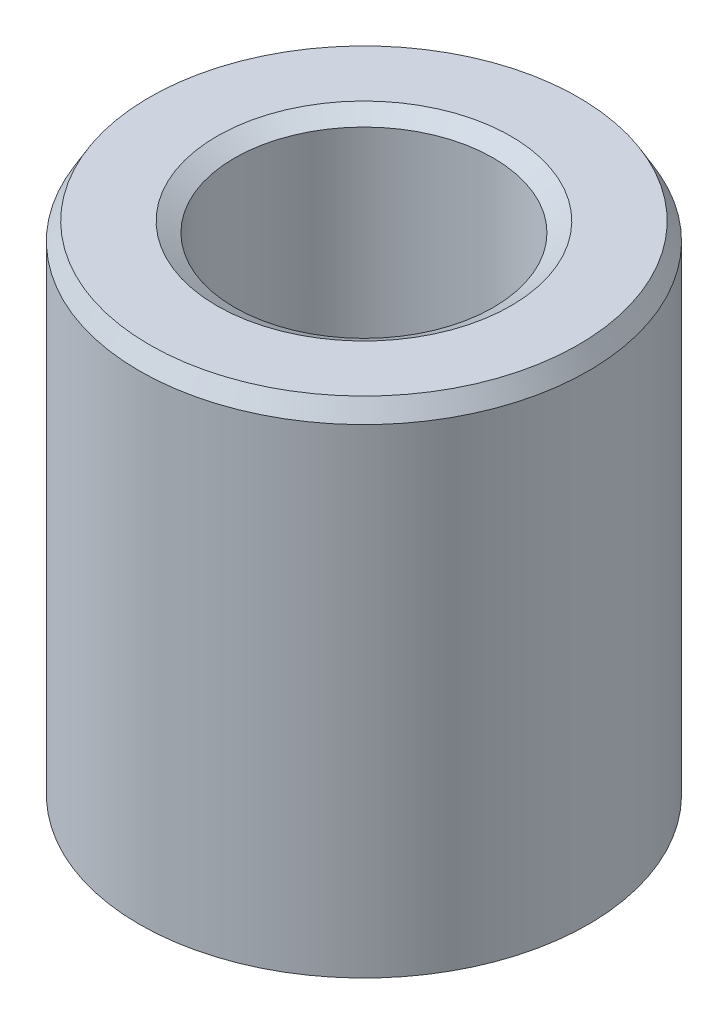
ISO-10303-21;
HEADER;
FILE_DESCRIPTION(('STEP AP214'),'2;1');
FILE_NAME('part.step','',(''),(''),'','','');
FILE_SCHEMA(('AUTOMOTIVE_DESIGN { 1 0 10303 214 1 1 1 1 }'));
ENDSEC;
DATA;
#1=APPLICATION_CONTEXT('core data for automotive mechanical design processes');
#2=APPLICATION_PROTOCOL_DEFINITION('international standard','automotive_design',2000,#1);
#3=PRODUCT_CONTEXT('',#1,'mechanical');
#4=PRODUCT('Part','Part','',(#3));
#5=PRODUCT_RELATED_PRODUCT_CATEGORY('part','',(#4));
#6=PRODUCT_DEFINITION_FORMATION('','',#4);
#7=PRODUCT_DEFINITION_CONTEXT('part definition',#1,'design');
#8=PRODUCT_DEFINITION('design','',#6,#7);
#9=PRODUCT_DEFINITION_SHAPE('','',#8);
#10=(LENGTH_UNIT() NAMED_UNIT(*) SI_UNIT(.MILLI.,.METRE.));
#11=(NAMED_UNIT(*) PLANE_ANGLE_UNIT() SI_UNIT($,.RADIAN.));
#12=(NAMED_UNIT(*) SI_UNIT($,.STERADIAN.) SOLID_ANGLE_UNIT());
#13=UNCERTAINTY_MEASURE_WITH_UNIT(LENGTH_MEASURE(1.E-05),#10,'distance_accuracy_value','');
#14=(GEOMETRIC_REPRESENTATION_CONTEXT(3) GLOBAL_UNCERTAINTY_ASSIGNED_CONTEXT((#13)) GLOBAL_UNIT_ASSIGNED_CONTEXT((#10,
#11,#12)) REPRESENTATION_CONTEXT('',''));
#15=CARTESIAN_POINT('',(0.,0.,0.));
#16=DIRECTION('',(0.,0.,1.));
#17=DIRECTION('',(1.,0.,0.));
#18=AXIS2_PLACEMENT_3D('',#15,#16,#17);
#19=CARTESIAN_POINT('',(0.,107.231433094291,0.));
#20=DIRECTION('',(0.,-1.,0.));
#21=DIRECTION('',(0.,0.,-1.));
#22=AXIS2_PLACEMENT_3D('',#19,#20,#21);
#23=CYLINDRICAL_SURFACE('',#22,47.5);
#24=CARTESIAN_POINT('',(0.,2.14270629740966,0.));
#25=DIRECTION('',(0.,1.,0.));
#26=DIRECTION('',(0.,0.,1.));
#27=AXIS2_PLACEMENT_3D('',#24,#25,#26);
#28=CIRCLE('',#27,47.5);
#29=CARTESIAN_POINT('',(0.,2.14270629740966,47.5));
#30=VERTEX_POINT('',#29);
#31=EDGE_CURVE('E10',#30,#30,#28,.T.);
#32=ORIENTED_EDGE('',*,*,#31,.T.);
#33=EDGE_LOOP('',(#32));
#34=FACE_BOUND('',#33,.T.);
#35=CARTESIAN_POINT('',(0.,103.52015692148,0.));
#36=DIRECTION('',(0.,1.,0.));
#37=DIRECTION('',(0.,0.,1.));
#38=AXIS2_PLACEMENT_3D('',#35,#36,#37);
#39=CIRCLE('',#38,47.5);
#40=CARTESIAN_POINT('',(0.,103.52015692148,47.5));
#41=VERTEX_POINT('',#40);
#42=EDGE_CURVE('E50',#41,#41,#39,.F.);
#43=ORIENTED_EDGE('',*,*,#42,.T.);
#44=EDGE_LOOP('',(#43));
#45=FACE_BOUND('',#44,.T.);
#46=ADVANCED_FACE('F39',(#34,#45),#23,.T.);
#47=CARTESIAN_POINT('',(0.,107.231433094291,0.));
#48=DIRECTION('',(0.,1.,0.));
#49=DIRECTION('',(0.,0.,1.));
#50=AXIS2_PLACEMENT_3D('',#47,#48,#49);
#51=PLANE('',#50);
#52=CARTESIAN_POINT('',(0.,107.231433094291,0.));
#53=DIRECTION('',(0.,1.,0.));
#54=DIRECTION('',(0.,0.,1.));
#55=AXIS2_PLACEMENT_3D('',#52,#53,#54);
#56=CIRCLE('',#55,31.0877086571542);
#57=CARTESIAN_POINT('',(0.,107.231433094291,31.0877086571542));
#58=VERTEX_POINT('',#57);
#59=EDGE_CURVE('E58',#58,#58,#56,.F.);
#60=ORIENTED_EDGE('',*,*,#59,.T.);
#61=EDGE_LOOP('',(#60));
#62=FACE_BOUND('',#61,.T.);
#63=CARTESIAN_POINT('',(0.,107.231433094291,0.));
#64=DIRECTION('',(0.,1.,0.));
#65=DIRECTION('',(0.,0.,1.));
#66=AXIS2_PLACEMENT_3D('',#63,#64,#65);
#67=CIRCLE('',#66,45.3572937025904);
#68=CARTESIAN_POINT('',(0.,107.231433094291,45.3572937025904));
#69=VERTEX_POINT('',#68);
#70=EDGE_CURVE('E61',#69,#69,#67,.T.);
#71=ORIENTED_EDGE('',*,*,#70,.T.);
#72=EDGE_LOOP('',(#71));
#73=FACE_BOUND('',#72,.T.);
#74=ADVANCED_FACE('F88',(#62,#73),#51,.T.);
#75=CARTESIAN_POINT('',(0.,0.,0.));
#76=DIRECTION('',(0.,1.,0.));
#77=DIRECTION('',(0.,0.,1.));
#78=AXIS2_PLACEMENT_3D('',#75,#76,#77);
#79=PLANE('',#78);
#80=CARTESIAN_POINT('',(0.,0.,0.));
#81=DIRECTION('',(0.,1.,0.));
#82=DIRECTION('',(0.,0.,1.));
#83=AXIS2_PLACEMENT_3D('',#80,#81,#82);
#84=CIRCLE('',#83,29.5191387817526);
#85=CARTESIAN_POINT('',(0.,0.,-29.5191387817526));
#86=VERTEX_POINT('',#85);
#87=EDGE_CURVE('E51',#86,#86,#84,.T.);
#88=ORIENTED_EDGE('',*,*,#87,.T.);
#89=EDGE_LOOP('',(#88));
#90=FACE_BOUND('',#89,.T.);
#91=CARTESIAN_POINT('',(0.,0.,0.));
#92=DIRECTION('',(0.,1.,0.));
#93=DIRECTION('',(0.,0.,1.));
#94=AXIS2_PLACEMENT_3D('',#91,#92,#93);
#95=CIRCLE('',#94,43.7887238271887);
#96=CARTESIAN_POINT('',(0.,0.,43.7887238271887));
#97=VERTEX_POINT('',#96);
#98=EDGE_CURVE('E54',#97,#97,#95,.F.);
#99=ORIENTED_EDGE('',*,*,#98,.T.);
#100=EDGE_LOOP('',(#99));
#101=FACE_BOUND('',#100,.T.);
#102=ADVANCED_FACE('F83',(#90,#101),#79,.F.);
#103=CARTESIAN_POINT('',(0.,107.231433094291,0.));
#104=DIRECTION('',(0.,-1.,0.));
#105=DIRECTION('',(0.,0.,-1.));
#106=AXIS2_PLACEMENT_3D('',#103,#104,#105);
#107=CYLINDRICAL_SURFACE('',#106,27.3764324843429);
#108=CARTESIAN_POINT('',(0.,105.088726796881,0.));
#109=DIRECTION('',(0.,1.,0.));
#110=DIRECTION('',(0.,0.,1.));
#111=AXIS2_PLACEMENT_3D('',#108,#109,#110);
#112=CIRCLE('',#111,27.3764324843429);
#113=CARTESIAN_POINT('',(0.,105.088726796881,27.3764324843429));
#114=VERTEX_POINT('',#113);
#115=EDGE_CURVE('E67',#114,#114,#112,.T.);
#116=ORIENTED_EDGE('',*,*,#115,.T.);
#117=EDGE_LOOP('',(#116));
#118=FACE_BOUND('',#117,.T.);
#119=CARTESIAN_POINT('',(0.,3.71127617281135,0.));
#120=DIRECTION('',(0.,1.,0.));
#121=DIRECTION('',(0.,0.,1.));
#122=AXIS2_PLACEMENT_3D('',#119,#120,#121);
#123=CIRCLE('',#122,27.3764324843429);
#124=CARTESIAN_POINT('',(0.,3.71127617281135,-27.3764324843429));
#125=VERTEX_POINT('',#124);
#126=EDGE_CURVE('E69',#125,#125,#123,.F.);
#127=ORIENTED_EDGE('',*,*,#126,.T.);
#128=EDGE_LOOP('',(#127));
#129=FACE_BOUND('',#128,.T.);
#130=ADVANCED_FACE('F71',(#118,#129),#107,.F.);
#131=CARTESIAN_POINT('',(0.,105.088726796881,0.));
#132=DIRECTION('',(0.,1.,0.));
#133=DIRECTION('',(0.,0.,1.));
#134=AXIS2_PLACEMENT_3D('',#131,#132,#133);
#135=CONICAL_SURFACE('',#134,27.3764324843429,1.0471975511966);
#136=ORIENTED_EDGE('',*,*,#59,.F.);
#137=EDGE_LOOP('',(#136));
#138=FACE_BOUND('',#137,.T.);
#139=ORIENTED_EDGE('',*,*,#115,.F.);
#140=EDGE_LOOP('',(#139));
#141=FACE_BOUND('',#140,.T.);
#142=ADVANCED_FACE('F77',(#138,#141),#135,.F.);
#143=CARTESIAN_POINT('',(0.,0.,0.));
#144=DIRECTION('',(0.,-1.,0.));
#145=DIRECTION('',(0.,0.,-1.));
#146=AXIS2_PLACEMENT_3D('',#143,#144,#145);
#147=CONICAL_SURFACE('',#146,29.5191387817526,0.523598775598292);
#148=CARTESIAN_POINT('',(0.,3.71127617281135,-27.3764324843429));
#149=CARTESIAN_POINT('',(0.,3.67261704601123,-27.3987523416076));
#150=CARTESIAN_POINT('',(0.,3.63395791921111,-27.4210721988723));
#151=CARTESIAN_POINT('',(0.,3.55663966561087,-27.4657119134017));
#152=CARTESIAN_POINT('',(0.,3.51798053881076,-27.4880317706663));
#153=CARTESIAN_POINT('',(0.,3.44066228521052,-27.5326714851957));
#154=CARTESIAN_POINT('',(0.,3.4020031584104,-27.5549913424604));
#155=CARTESIAN_POINT('',(0.,3.32468490481017,-27.5996310569898));
#156=CARTESIAN_POINT('',(0.,3.28602577801005,-27.6219509142544));
#157=CARTESIAN_POINT('',(0.,3.20870752440981,-27.6665906287838));
#158=CARTESIAN_POINT('',(0.,3.17004839760969,-27.6889104860485));
#159=CARTESIAN_POINT('',(0.,3.09273014400946,-27.7335502005779));
#160=CARTESIAN_POINT('',(0.,3.05407101720934,-27.7558700578426));
#161=CARTESIAN_POINT('',(0.,2.9767527636091,-27.8005097723719));
#162=CARTESIAN_POINT('',(0.,2.93809363680898,-27.8228296296366));
#163=CARTESIAN_POINT('',(0.,2.86077538320875,-27.867469344166));
#164=CARTESIAN_POINT('',(0.,2.82211625640863,-27.8897892014307));
#165=CARTESIAN_POINT('',(0.,2.74479800280839,-27.93442891596));
#166=CARTESIAN_POINT('',(0.,2.70613887600827,-27.9567487732247));
#167=CARTESIAN_POINT('',(0.,2.62882062240804,-28.0013884877541));
#168=CARTESIAN_POINT('',(0.,2.59016149560792,-28.0237083450188));
#169=CARTESIAN_POINT('',(0.,2.51284324200768,-28.0683480595481));
#170=CARTESIAN_POINT('',(0.,2.47418411520756,-28.0906679168128));
#171=CARTESIAN_POINT('',(0.,2.39686586160733,-28.1353076313422));
#172=CARTESIAN_POINT('',(0.,2.35820673480721,-28.1576274886069));
#173=CARTESIAN_POINT('',(0.,2.28088848120697,-28.2022672031362));
#174=CARTESIAN_POINT('',(0.,2.24222935440686,-28.2245870604009));
#175=CARTESIAN_POINT('',(0.,2.16491110080662,-28.2692267749303));
#176=CARTESIAN_POINT('',(0.,2.1262519740065,-28.291546632195));
#177=CARTESIAN_POINT('',(0.,2.04893372040626,-28.3361863467243));
#178=CARTESIAN_POINT('',(0.,2.01027459360615,-28.358506203989));
#179=CARTESIAN_POINT('',(0.,1.93295634000591,-28.4031459185184));
#180=CARTESIAN_POINT('',(0.,1.89429721320579,-28.4254657757831));
#181=CARTESIAN_POINT('',(0.,1.81697895960555,-28.4701054903124));
#182=CARTESIAN_POINT('',(0.,1.77831983280544,-28.4924253475771));
#183=CARTESIAN_POINT('',(0.,1.7010015792052,-28.5370650621065));
#184=CARTESIAN_POINT('',(0.,1.66234245240508,-28.5593849193712));
#185=CARTESIAN_POINT('',(0.,1.58502419880485,-28.6040246339005));
#186=CARTESIAN_POINT('',(0.,1.54636507200473,-28.6263444911652));
#187=CARTESIAN_POINT('',(0.,1.46904681840449,-28.6709842056946));
#188=CARTESIAN_POINT('',(0.,1.43038769160437,-28.6933040629593));
#189=CARTESIAN_POINT('',(0.,1.35306943800414,-28.7379437774886));
#190=CARTESIAN_POINT('',(0.,1.31441031120402,-28.7602636347533));
#191=CARTESIAN_POINT('',(0.,1.23709205760378,-28.8049033492827));
#192=CARTESIAN_POINT('',(0.,1.19843293080366,-28.8272232065474));
#193=CARTESIAN_POINT('',(0.,1.12111467720343,-28.8718629210767));
#194=CARTESIAN_POINT('',(0.,1.08245555040331,-28.8941827783414));
#195=CARTESIAN_POINT('',(0.,1.00513729680307,-28.9388224928708));
#196=CARTESIAN_POINT('',(0.,0.966478170002955,-28.9611423501355));
#197=CARTESIAN_POINT('',(0.,0.889159916402719,-29.0057820646648));
#198=CARTESIAN_POINT('',(0.,0.8505007896026,-29.0281019219295));
#199=CARTESIAN_POINT('',(0.,0.773182536002364,-29.0727416364589));
#200=CARTESIAN_POINT('',(0.,0.734523409202246,-29.0950614937236));
#201=CARTESIAN_POINT('',(0.,0.657205155602009,-29.1397012082529));
#202=CARTESIAN_POINT('',(0.,0.618546028801891,-29.1620210655176));
#203=CARTESIAN_POINT('',(0.,0.541227775201655,-29.206660780047));
#204=CARTESIAN_POINT('',(0.,0.502568648401537,-29.2289806373117));
#205=CARTESIAN_POINT('',(0.,0.4252503948013,-29.273620351841));
#206=CARTESIAN_POINT('',(0.,0.386591268001182,-29.2959402091057));
#207=CARTESIAN_POINT('',(0.,0.309273014400946,-29.3405799236351));
#208=CARTESIAN_POINT('',(0.,0.270613887600827,-29.3628997808998));
#209=CARTESIAN_POINT('',(0.,0.193295634000591,-29.4075394954291));
#210=CARTESIAN_POINT('',(0.,0.154636507200473,-29.4298593526938));
#211=CARTESIAN_POINT('',(0.,0.0773182536002364,-29.4744990672232));
#212=CARTESIAN_POINT('',(0.,0.0386591268001182,-29.4968189244879));
#213=CARTESIAN_POINT('',(0.,0.,-29.5191387817526));
#214=B_SPLINE_CURVE_WITH_KNOTS('',3,(#148,#149,#150,#151,#152,#153,#154,#155,#156,#157,#158,
#159,#160,#161,#162,#163,#164,#165,#166,#167,#168,#169,#170,#171,#172,#173,#174,#175,#176,#177,
#178,#179,#180,#181,#182,#183,#184,#185,#186,#187,#188,#189,#190,#191,#192,#193,#194,#195,#196,
#197,#198,#199,#200,#201,#202,#203,#204,#205,#206,#207,#208,#209,#210,#211,#212,#213),
.UNSPECIFIED.,.F.,.F.,(4,2,2,2,2,2,2,2,2,2,2,2,2,2,2,2,2,2,2,2,2,2,2,2,2,2,2,2,2,2,2,2,4),(0.,
0.133919143588104,0.267838287176209,0.401757430764313,0.535676574352417,0.669595717940521,
0.803514861528626,0.93743400511673,1.07135314870483,1.20527229229294,1.33919143588104,
1.47311057946915,1.60702972305725,1.74094886664535,1.87486801023346,2.00878715382156,
2.14270629740967,2.27662544099777,2.41054458458587,2.54446372817398,2.67838287176208,
2.81230201535019,2.94622115893829,3.0801403025264,3.2140594461145,3.3479785897026,
3.48189773329071,3.61581687687881,3.74973602046692,3.88365516405502,4.01757430764313,
4.15149345123123,4.28541259481934),.UNSPECIFIED.);
#215=EDGE_CURVE('BSEAM73',#125,#86,#214,.T.);
#216=ORIENTED_EDGE('',*,*,#126,.F.);
#217=ORIENTED_EDGE('',*,*,#87,.F.);
#218=ORIENTED_EDGE('',*,*,#215,.T.);
#219=ORIENTED_EDGE('',*,*,#215,.F.);
#220=EDGE_LOOP('',(#216,#218,#217,#219));
#221=FACE_BOUND('',#220,.T.);
#222=ADVANCED_FACE('F73',(#221),#147,.F.);
#223=CARTESIAN_POINT('',(0.,2.14270629740966,0.));
#224=DIRECTION('',(0.,1.,0.));
#225=DIRECTION('',(0.,0.,1.));
#226=AXIS2_PLACEMENT_3D('',#223,#224,#225);
#227=CONICAL_SURFACE('',#226,47.5,1.0471975511966);
#228=CARTESIAN_POINT('',(0.,0.,43.7887238271887));
#229=CARTESIAN_POINT('',(0.,0.0223198572646834,43.8273829539888));
#230=CARTESIAN_POINT('',(0.,0.0446397145293675,43.8660420807889));
#231=CARTESIAN_POINT('',(0.,0.0892794290587355,43.9433603343891));
#232=CARTESIAN_POINT('',(0.,0.111599286323419,43.9820194611893));
#233=CARTESIAN_POINT('',(0.,0.156239000852787,44.0593377147895));
#234=CARTESIAN_POINT('',(0.,0.178558858117471,44.0979968415896));
#235=CARTESIAN_POINT('',(0.,0.223198572646839,44.1753150951898));
#236=CARTESIAN_POINT('',(0.,0.245518429911524,44.21397422199));
#237=CARTESIAN_POINT('',(0.,0.290158144440891,44.2912924755902));
#238=CARTESIAN_POINT('',(0.,0.312478001705574,44.3299516023903));
#239=CARTESIAN_POINT('',(0.,0.357117716234942,44.4072698559906));
#240=CARTESIAN_POINT('',(0.,0.379437573499627,44.4459289827907));
#241=CARTESIAN_POINT('',(0.,0.424077288028995,44.5232472363909));
#242=CARTESIAN_POINT('',(0.,0.446397145293679,44.561906363191));
#243=CARTESIAN_POINT('',(0.,0.491036859823047,44.6392246167913));
#244=CARTESIAN_POINT('',(0.,0.513356717087731,44.6778837435914));
#245=CARTESIAN_POINT('',(0.,0.557996431617098,44.7552019971916));
#246=CARTESIAN_POINT('',(0.,0.580316288881782,44.7938611239917));
#247=CARTESIAN_POINT('',(0.,0.62495600341115,44.871179377592));
#248=CARTESIAN_POINT('',(0.,0.647275860675835,44.9098385043921));
#249=CARTESIAN_POINT('',(0.,0.691915575205203,44.9871567579923));
#250=CARTESIAN_POINT('',(0.,0.714235432469886,45.0258158847924));
#251=CARTESIAN_POINT('',(0.,0.758875146999254,45.1031341383927));
#252=CARTESIAN_POINT('',(0.,0.781195004263938,45.1417932651928));
#253=CARTESIAN_POINT('',(0.,0.825834718793306,45.219111518793));
#254=CARTESIAN_POINT('',(0.,0.84815457605799,45.2577706455932));
#255=CARTESIAN_POINT('',(0.,0.892794290587358,45.3350888991934));
#256=CARTESIAN_POINT('',(0.,0.915114147852042,45.3737480259935));
#257=CARTESIAN_POINT('',(0.,0.95975386238141,45.4510662795937));
#258=CARTESIAN_POINT('',(0.,0.982073719646094,45.4897254063939));
#259=CARTESIAN_POINT('',(0.,1.02671343417546,45.5670436599941));
#260=CARTESIAN_POINT('',(0.,1.04903329144015,45.6057027867942));
#261=CARTESIAN_POINT('',(0.,1.09367300596951,45.6830210403945));
#262=CARTESIAN_POINT('',(0.,1.1159928632342,45.7216801671946));
#263=CARTESIAN_POINT('',(0.,1.16063257776357,45.7989984207948));
#264=CARTESIAN_POINT('',(0.,1.18295243502825,45.8376575475949));
#265=CARTESIAN_POINT('',(0.,1.22759214955762,45.9149758011952));
#266=CARTESIAN_POINT('',(0.,1.2499120068223,45.9536349279953));
#267=CARTESIAN_POINT('',(0.,1.29455172135167,46.0309531815955));
#268=CARTESIAN_POINT('',(0.,1.31687157861635,46.0696123083956));
#269=CARTESIAN_POINT('',(0.,1.36151129314572,46.1469305619959));
#270=CARTESIAN_POINT('',(0.,1.38383115041041,46.185589688796));
#271=CARTESIAN_POINT('',(0.,1.42847086493977,46.2629079423962));
#272=CARTESIAN_POINT('',(0.,1.45079072220446,46.3015670691963));
#273=CARTESIAN_POINT('',(0.,1.49543043673383,46.3788853227966));
#274=CARTESIAN_POINT('',(0.,1.51775029399851,46.4175444495967));
#275=CARTESIAN_POINT('',(0.,1.56239000852788,46.4948627031969));
#276=CARTESIAN_POINT('',(0.,1.58470986579256,46.533521829997));
#277=CARTESIAN_POINT('',(0.,1.62934958032193,46.6108400835973));
#278=CARTESIAN_POINT('',(0.,1.65166943758661,46.6494992103974));
#279=CARTESIAN_POINT('',(0.,1.69630915211598,46.7268174639976));
#280=CARTESIAN_POINT('',(0.,1.71862900938066,46.7654765907978));
#281=CARTESIAN_POINT('',(0.,1.76326872391003,46.842794844398));
#282=CARTESIAN_POINT('',(0.,1.78558858117472,46.8814539711981));
#283=CARTESIAN_POINT('',(0.,1.83022829570408,46.9587722247984));
#284=CARTESIAN_POINT('',(0.,1.85254815296877,46.9974313515985));
#285=CARTESIAN_POINT('',(0.,1.89718786749814,47.0747496051987));
#286=CARTESIAN_POINT('',(0.,1.91950772476282,47.1134087319988));
#287=CARTESIAN_POINT('',(0.,1.96414743929219,47.1907269855991));
#288=CARTESIAN_POINT('',(0.,1.98646729655687,47.2293861123992));
#289=CARTESIAN_POINT('',(0.,2.03110701108624,47.3067043659994));
#290=CARTESIAN_POINT('',(0.,2.05342686835092,47.3453634927995));
#291=CARTESIAN_POINT('',(0.,2.09806658288029,47.4226817463998));
#292=CARTESIAN_POINT('',(0.,2.12038644014498,47.4613408731999));
#293=CARTESIAN_POINT('',(0.,2.14270629740966,47.5));
#294=B_SPLINE_CURVE_WITH_KNOTS('',3,(#228,#229,#230,#231,#232,#233,#234,#235,#236,#237,#238,
#239,#240,#241,#242,#243,#244,#245,#246,#247,#248,#249,#250,#251,#252,#253,#254,#255,#256,#257,
#258,#259,#260,#261,#262,#263,#264,#265,#266,#267,#268,#269,#270,#271,#272,#273,#274,#275,#276,
#277,#278,#279,#280,#281,#282,#283,#284,#285,#286,#287,#288,#289,#290,#291,#292,#293),
.UNSPECIFIED.,.F.,.F.,(4,2,2,2,2,2,2,2,2,2,2,2,2,2,2,2,2,2,2,2,2,2,2,2,2,2,2,2,2,2,2,2,4),(0.,
0.133919143588103,0.267838287176207,0.40175743076431,0.535676574352413,0.669595717940523,
0.803514861528626,0.93743400511673,1.07135314870483,1.20527229229294,1.33919143588104,
1.47311057946915,1.60702972305725,1.74094886664536,1.87486801023346,2.00878715382156,
2.14270629740967,2.27662544099777,2.41054458458588,2.54446372817398,2.67838287176209,
2.81230201535019,2.94622115893829,3.0801403025264,3.21405944611451,3.34797858970261,
3.48189773329071,3.61581687687882,3.74973602046692,3.88365516405502,4.01757430764313,
4.15149345123123,4.28541259481934),.UNSPECIFIED.);
#295=EDGE_CURVE('BSEAM76',#97,#30,#294,.T.);
#296=ORIENTED_EDGE('',*,*,#98,.F.);
#297=ORIENTED_EDGE('',*,*,#31,.F.);
#298=ORIENTED_EDGE('',*,*,#295,.T.);
#299=ORIENTED_EDGE('',*,*,#295,.F.);
#300=EDGE_LOOP('',(#296,#298,#297,#299));
#301=FACE_BOUND('',#300,.T.);
#302=ADVANCED_FACE('F76',(#301),#227,.T.);
#303=CARTESIAN_POINT('',(0.,107.231433094291,0.));
#304=DIRECTION('',(0.,-1.,0.));
#305=DIRECTION('',(0.,0.,-1.));
#306=AXIS2_PLACEMENT_3D('',#303,#304,#305);
#307=CONICAL_SURFACE('',#306,45.3572937025904,0.523598775598291);
#308=ORIENTED_EDGE('',*,*,#42,.F.);
#309=EDGE_LOOP('',(#308));
#310=FACE_BOUND('',#309,.T.);
#311=ORIENTED_EDGE('',*,*,#70,.F.);
#312=EDGE_LOOP('',(#311));
#313=FACE_BOUND('',#312,.T.);
#314=ADVANCED_FACE('F45',(#310,#313),#307,.T.);
#315=CLOSED_SHELL('',(#46,#74,#102,#130,#142,#222,#302,#314));
#316=MANIFOLD_SOLID_BREP('B2',#315);
#317=ADVANCED_BREP_SHAPE_REPRESENTATION('',(#18,#316),#14);
#318=SHAPE_DEFINITION_REPRESENTATION(#9,#317);
ENDSEC;
END-ISO-10303-21;
